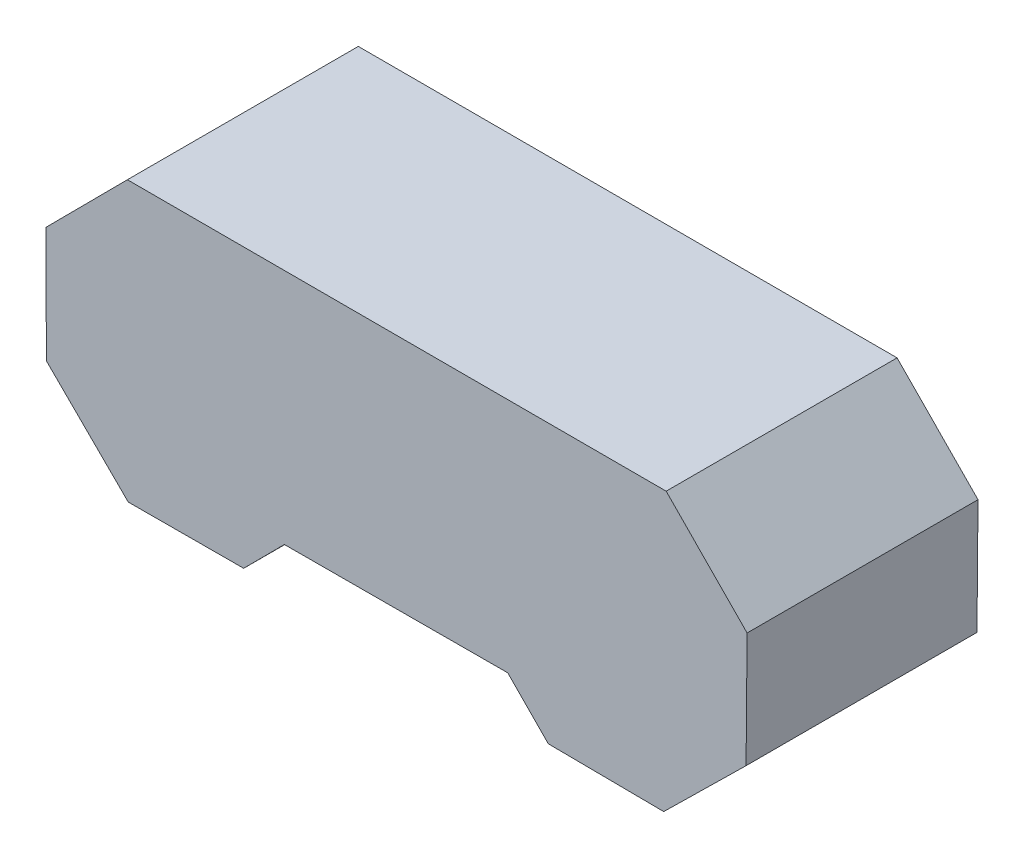
ISO-10303-21;
HEADER;
FILE_DESCRIPTION(('STEP AP214'),'2;1');
FILE_NAME('part.step','',(''),(''),'','','');
FILE_SCHEMA(('AUTOMOTIVE_DESIGN { 1 0 10303 214 1 1 1 1 }'));
ENDSEC;
DATA;
#1=APPLICATION_CONTEXT('core data for automotive mechanical design processes');
#2=APPLICATION_PROTOCOL_DEFINITION('international standard','automotive_design',2000,#1);
#3=PRODUCT_CONTEXT('',#1,'mechanical');
#4=PRODUCT('Part','Part','',(#3));
#5=PRODUCT_RELATED_PRODUCT_CATEGORY('part','',(#4));
#6=PRODUCT_DEFINITION_FORMATION('','',#4);
#7=PRODUCT_DEFINITION_CONTEXT('part definition',#1,'design');
#8=PRODUCT_DEFINITION('design','',#6,#7);
#9=PRODUCT_DEFINITION_SHAPE('','',#8);
#10=(LENGTH_UNIT() NAMED_UNIT(*) SI_UNIT(.MILLI.,.METRE.));
#11=(NAMED_UNIT(*) PLANE_ANGLE_UNIT() SI_UNIT($,.RADIAN.));
#12=(NAMED_UNIT(*) SI_UNIT($,.STERADIAN.) SOLID_ANGLE_UNIT());
#13=UNCERTAINTY_MEASURE_WITH_UNIT(LENGTH_MEASURE(1.E-05),#10,'distance_accuracy_value','');
#14=(GEOMETRIC_REPRESENTATION_CONTEXT(3) GLOBAL_UNCERTAINTY_ASSIGNED_CONTEXT((#13)) GLOBAL_UNIT_ASSIGNED_CONTEXT((#10,
#11,#12)) REPRESENTATION_CONTEXT('',''));
#15=CARTESIAN_POINT('',(0.,0.,0.));
#16=DIRECTION('',(0.,0.,1.));
#17=DIRECTION('',(1.,0.,0.));
#18=AXIS2_PLACEMENT_3D('',#15,#16,#17);
#19=CARTESIAN_POINT('',(-244.661916319518,37.8470245384613,152.4));
#20=DIRECTION('',(0.999995319641671,0.00305952524957669,0.));
#21=DIRECTION('',(-0.00305952524957669,0.999995319641671,0.));
#22=AXIS2_PLACEMENT_3D('',#19,#20,#21);
#23=PLANE('',#22);
#24=DIRECTION('',(0.00305952524957669,-0.999995319641671,0.));
#25=VECTOR('',#24,1.);
#26=CARTESIAN_POINT('',(-244.661916319518,37.8470245384613,0.));
#27=LINE('',#26,#25);
#28=CARTESIAN_POINT('',(-244.661916319518,37.8470245384613,0.));
#29=VERTEX_POINT('',#28);
#30=CARTESIAN_POINT('',(-244.428771462345,-38.3555712740827,0.));
#31=VERTEX_POINT('',#30);
#32=EDGE_CURVE('E154',#29,#31,#27,.T.);
#33=ORIENTED_EDGE('',*,*,#32,.T.);
#34=DIRECTION('',(0.,0.,-1.));
#35=VECTOR('',#34,1.);
#36=CARTESIAN_POINT('',(-244.428771462345,-38.3555712740827,152.4));
#37=LINE('',#36,#35);
#38=CARTESIAN_POINT('',(-244.428771462345,-38.3555712740827,152.4));
#39=VERTEX_POINT('',#38);
#40=EDGE_CURVE('E11',#39,#31,#37,.T.);
#41=ORIENTED_EDGE('',*,*,#40,.F.);
#42=DIRECTION('',(0.00305952524957669,-0.999995319641671,0.));
#43=VECTOR('',#42,1.);
#44=CARTESIAN_POINT('',(-244.661916319518,37.8470245384613,152.4));
#45=LINE('',#44,#43);
#46=CARTESIAN_POINT('',(-244.661916319518,37.8470245384613,152.4));
#47=VERTEX_POINT('',#46);
#48=EDGE_CURVE('E176',#47,#39,#45,.T.);
#49=ORIENTED_EDGE('',*,*,#48,.F.);
#50=DIRECTION('',(0.,0.,-1.));
#51=VECTOR('',#50,1.);
#52=CARTESIAN_POINT('',(-244.661916319518,37.8470245384613,152.4));
#53=LINE('',#52,#51);
#54=EDGE_CURVE('E150',#47,#29,#53,.T.);
#55=ORIENTED_EDGE('',*,*,#54,.T.);
#56=EDGE_LOOP('',(#33,#41,#49,#55));
#57=FACE_BOUND('',#56,.T.);
#58=ADVANCED_FACE('F34',(#57),#23,.F.);
#59=CARTESIAN_POINT('',(-244.428771462345,-38.3555712740827,152.4));
#60=DIRECTION('',(0.704940060622248,0.709266882724621,0.));
#61=DIRECTION('',(-0.709266882724621,0.704940060622248,0.));
#62=AXIS2_PLACEMENT_3D('',#59,#60,#61);
#63=PLANE('',#62);
#64=DIRECTION('',(0.709266882724621,-0.704940060622248,0.));
#65=VECTOR('',#64,1.);
#66=CARTESIAN_POINT('',(-244.428771462345,-38.3555712740827,0.));
#67=LINE('',#66,#65);
#68=CARTESIAN_POINT('',(-190.380540909772,-92.0740852076443,0.));
#69=VERTEX_POINT('',#68);
#70=EDGE_CURVE('E157',#31,#69,#67,.T.);
#71=ORIENTED_EDGE('',*,*,#70,.T.);
#72=DIRECTION('',(0.,0.,-1.));
#73=VECTOR('',#72,1.);
#74=CARTESIAN_POINT('',(-190.380540909772,-92.0740852076443,152.4));
#75=LINE('',#74,#73);
#76=CARTESIAN_POINT('',(-190.380540909772,-92.0740852076443,152.4));
#77=VERTEX_POINT('',#76);
#78=EDGE_CURVE('E42',#77,#69,#75,.T.);
#79=ORIENTED_EDGE('',*,*,#78,.F.);
#80=DIRECTION('',(0.709266882724621,-0.704940060622248,0.));
#81=VECTOR('',#80,1.);
#82=CARTESIAN_POINT('',(-244.428771462345,-38.3555712740827,152.4));
#83=LINE('',#82,#81);
#84=EDGE_CURVE('E105',#39,#77,#83,.T.);
#85=ORIENTED_EDGE('',*,*,#84,.F.);
#86=ORIENTED_EDGE('',*,*,#40,.T.);
#87=EDGE_LOOP('',(#71,#79,#85,#86));
#88=FACE_BOUND('',#87,.T.);
#89=ADVANCED_FACE('F254',(#88),#63,.F.);
#90=CARTESIAN_POINT('',(-190.380540909772,-92.0740852076443,152.4));
#91=DIRECTION('',(-0.00305952524957669,0.999995319641671,0.));
#92=DIRECTION('',(-0.999995319641671,-0.00305952524957669,0.));
#93=AXIS2_PLACEMENT_3D('',#90,#91,#92);
#94=PLANE('',#93);
#95=DIRECTION('',(0.999995319641671,0.00305952524957669,0.));
#96=VECTOR('',#95,1.);
#97=CARTESIAN_POINT('',(-190.380540909772,-92.0740852076443,0.));
#98=LINE('',#97,#96);
#99=CARTESIAN_POINT('',(-114.177945097228,-91.840940350471,0.));
#100=VERTEX_POINT('',#99);
#101=EDGE_CURVE('E159',#69,#100,#98,.T.);
#102=ORIENTED_EDGE('',*,*,#101,.T.);
#103=DIRECTION('',(0.,0.,-1.));
#104=VECTOR('',#103,1.);
#105=CARTESIAN_POINT('',(-114.177945097228,-91.840940350471,152.4));
#106=LINE('',#105,#104);
#107=CARTESIAN_POINT('',(-114.177945097228,-91.840940350471,152.4));
#108=VERTEX_POINT('',#107);
#109=EDGE_CURVE('E195',#108,#100,#106,.T.);
#110=ORIENTED_EDGE('',*,*,#109,.F.);
#111=DIRECTION('',(0.999995319641671,0.00305952524957669,0.));
#112=VECTOR('',#111,1.);
#113=CARTESIAN_POINT('',(-190.380540909772,-92.0740852076443,152.4));
#114=LINE('',#113,#112);
#115=EDGE_CURVE('E203',#77,#108,#114,.T.);
#116=ORIENTED_EDGE('',*,*,#115,.F.);
#117=ORIENTED_EDGE('',*,*,#78,.T.);
#118=EDGE_LOOP('',(#102,#110,#116,#117));
#119=FACE_BOUND('',#118,.T.);
#120=ADVANCED_FACE('F201',(#119),#94,.F.);
#121=CARTESIAN_POINT('',(-114.177945097228,-91.840940350471,152.4));
#122=DIRECTION('',(-0.709266882724622,0.704940060622247,0.));
#123=DIRECTION('',(-0.704940060622247,-0.709266882724622,0.));
#124=AXIS2_PLACEMENT_3D('',#121,#122,#123);
#125=PLANE('',#124);
#126=DIRECTION('',(0.704940060622247,0.709266882724622,0.));
#127=VECTOR('',#126,1.);
#128=CARTESIAN_POINT('',(-114.177945097228,-91.840940350471,0.));
#129=LINE('',#128,#127);
#130=CARTESIAN_POINT('',(-87.31972878752,-64.8178721186629,0.));
#131=VERTEX_POINT('',#130);
#132=EDGE_CURVE('E161',#100,#131,#129,.T.);
#133=ORIENTED_EDGE('',*,*,#132,.T.);
#134=DIRECTION('',(0.,0.,-1.));
#135=VECTOR('',#134,1.);
#136=CARTESIAN_POINT('',(-87.31972878752,-64.8178721186629,152.4));
#137=LINE('',#136,#135);
#138=CARTESIAN_POINT('',(-87.31972878752,-64.8178721186629,152.4));
#139=VERTEX_POINT('',#138);
#140=EDGE_CURVE('E192',#139,#131,#137,.T.);
#141=ORIENTED_EDGE('',*,*,#140,.F.);
#142=DIRECTION('',(0.704940060622247,0.709266882724622,0.));
#143=VECTOR('',#142,1.);
#144=CARTESIAN_POINT('',(-114.177945097228,-91.840940350471,152.4));
#145=LINE('',#144,#143);
#146=EDGE_CURVE('E221',#108,#139,#145,.T.);
#147=ORIENTED_EDGE('',*,*,#146,.F.);
#148=ORIENTED_EDGE('',*,*,#109,.T.);
#149=EDGE_LOOP('',(#133,#141,#147,#148));
#150=FACE_BOUND('',#149,.T.);
#151=ADVANCED_FACE('F212',(#150),#125,.F.);
#152=CARTESIAN_POINT('',(60.1345846239641,-64.4421052190364,152.4));
#153=DIRECTION('',(-0.00254835325461883,0.999996752942573,0.));
#154=DIRECTION('',(-0.999996752942573,-0.00254835325461883,0.));
#155=AXIS2_PLACEMENT_3D('',#152,#153,#154);
#156=PLANE('',#155);
#157=DIRECTION('',(0.999996752942573,0.00254835325461883,0.));
#158=VECTOR('',#157,1.);
#159=CARTESIAN_POINT('',(60.1345846239641,-64.4421052190364,0.));
#160=LINE('',#159,#158);
#161=CARTESIAN_POINT('',(60.1345846239641,-64.4421052190364,0.));
#162=VERTEX_POINT('',#161);
#163=EDGE_CURVE('E163',#131,#162,#160,.T.);
#164=ORIENTED_EDGE('',*,*,#163,.T.);
#165=DIRECTION('',(0.,0.,-1.));
#166=VECTOR('',#165,1.);
#167=CARTESIAN_POINT('',(60.1345846239641,-64.4421052190364,152.4));
#168=LINE('',#167,#166);
#169=CARTESIAN_POINT('',(60.1345846239641,-64.4421052190364,152.4));
#170=VERTEX_POINT('',#169);
#171=EDGE_CURVE('E189',#170,#162,#168,.T.);
#172=ORIENTED_EDGE('',*,*,#171,.F.);
#173=DIRECTION('',(0.999996752942573,0.00254835325461883,0.));
#174=VECTOR('',#173,1.);
#175=CARTESIAN_POINT('',(60.1345846239641,-64.4421052190364,152.4));
#176=LINE('',#175,#174);
#177=EDGE_CURVE('E218',#139,#170,#176,.T.);
#178=ORIENTED_EDGE('',*,*,#177,.F.);
#179=ORIENTED_EDGE('',*,*,#140,.T.);
#180=EDGE_LOOP('',(#164,#172,#178,#179));
#181=FACE_BOUND('',#180,.T.);
#182=ADVANCED_FACE('F216',(#181),#156,.F.);
#183=CARTESIAN_POINT('',(60.1345846239641,-64.4421052190364,152.4));
#184=DIRECTION('',(0.713303857876605,0.700854911046753,0.));
#185=DIRECTION('',(-0.700854911046753,0.713303857876605,0.));
#186=AXIS2_PLACEMENT_3D('',#183,#184,#185);
#187=PLANE('',#186);
#188=DIRECTION('',(0.700854911046753,-0.713303857876605,0.));
#189=VECTOR('',#188,1.);
#190=CARTESIAN_POINT('',(60.1345846239641,-64.4421052190364,0.));
#191=LINE('',#190,#189);
#192=CARTESIAN_POINT('',(86.8371567348454,-91.6189822041351,0.));
#193=VERTEX_POINT('',#192);
#194=EDGE_CURVE('E165',#162,#193,#191,.T.);
#195=ORIENTED_EDGE('',*,*,#194,.T.);
#196=DIRECTION('',(0.,0.,-1.));
#197=VECTOR('',#196,1.);
#198=CARTESIAN_POINT('',(86.8371567348454,-91.6189822041351,152.4));
#199=LINE('',#198,#197);
#200=CARTESIAN_POINT('',(86.8371567348454,-91.6189822041351,152.4));
#201=VERTEX_POINT('',#200);
#202=EDGE_CURVE('E186',#201,#193,#199,.T.);
#203=ORIENTED_EDGE('',*,*,#202,.F.);
#204=DIRECTION('',(0.700854911046753,-0.713303857876605,0.));
#205=VECTOR('',#204,1.);
#206=CARTESIAN_POINT('',(60.1345846239641,-64.4421052190364,152.4));
#207=LINE('',#206,#205);
#208=EDGE_CURVE('E220',#170,#201,#207,.T.);
#209=ORIENTED_EDGE('',*,*,#208,.F.);
#210=ORIENTED_EDGE('',*,*,#171,.T.);
#211=EDGE_LOOP('',(#195,#203,#209,#210));
#212=FACE_BOUND('',#211,.T.);
#213=ADVANCED_FACE('F267',(#212),#187,.F.);
#214=CARTESIAN_POINT('',(86.8371567348454,-91.6189822041351,152.4));
#215=DIRECTION('',(0.0088027347220188,0.999961255180126,0.));
#216=DIRECTION('',(-0.999961255180126,0.0088027347220188,0.));
#217=AXIS2_PLACEMENT_3D('',#214,#215,#216);
#218=PLANE('',#217);
#219=DIRECTION('',(0.999961255180126,-0.0088027347220188,0.));
#220=VECTOR('',#219,1.);
#221=CARTESIAN_POINT('',(86.8371567348454,-91.6189822041351,0.));
#222=LINE('',#221,#220);
#223=CARTESIAN_POINT('',(163.037156734845,-92.2897765797602,0.));
#224=VERTEX_POINT('',#223);
#225=EDGE_CURVE('E167',#193,#224,#222,.T.);
#226=ORIENTED_EDGE('',*,*,#225,.T.);
#227=DIRECTION('',(0.,0.,-1.));
#228=VECTOR('',#227,1.);
#229=CARTESIAN_POINT('',(163.037156734845,-92.2897765797602,152.4));
#230=LINE('',#229,#228);
#231=CARTESIAN_POINT('',(163.037156734845,-92.2897765797602,152.4));
#232=VERTEX_POINT('',#231);
#233=EDGE_CURVE('E183',#232,#224,#230,.T.);
#234=ORIENTED_EDGE('',*,*,#233,.F.);
#235=DIRECTION('',(0.999961255180126,-0.0088027347220188,0.));
#236=VECTOR('',#235,1.);
#237=CARTESIAN_POINT('',(86.8371567348454,-91.6189822041351,152.4));
#238=LINE('',#237,#236);
#239=EDGE_CURVE('E223',#201,#232,#238,.T.);
#240=ORIENTED_EDGE('',*,*,#239,.F.);
#241=ORIENTED_EDGE('',*,*,#202,.T.);
#242=EDGE_LOOP('',(#226,#234,#240,#241));
#243=FACE_BOUND('',#242,.T.);
#244=ADVANCED_FACE('F270',(#243),#218,.F.);
#245=CARTESIAN_POINT('',(163.037156734845,-92.2897765797602,152.4));
#246=DIRECTION('',(-0.700854911046753,0.713303857876605,0.));
#247=DIRECTION('',(-0.713303857876605,-0.700854911046753,0.));
#248=AXIS2_PLACEMENT_3D('',#245,#246,#247);
#249=PLANE('',#248);
#250=DIRECTION('',(0.713303857876605,0.700854911046753,0.));
#251=VECTOR('',#250,1.);
#252=CARTESIAN_POINT('',(163.037156734845,-92.2897765797602,0.));
#253=LINE('',#252,#251);
#254=CARTESIAN_POINT('',(217.393016713047,-38.8825631051315,0.));
#255=VERTEX_POINT('',#254);
#256=EDGE_CURVE('E169',#224,#255,#253,.T.);
#257=ORIENTED_EDGE('',*,*,#256,.T.);
#258=DIRECTION('',(0.,0.,-1.));
#259=VECTOR('',#258,1.);
#260=CARTESIAN_POINT('',(217.393016713047,-38.8825631051315,152.4));
#261=LINE('',#260,#259);
#262=CARTESIAN_POINT('',(217.393016713047,-38.8825631051315,152.4));
#263=VERTEX_POINT('',#262);
#264=EDGE_CURVE('E180',#263,#255,#261,.T.);
#265=ORIENTED_EDGE('',*,*,#264,.F.);
#266=DIRECTION('',(0.713303857876605,0.700854911046753,0.));
#267=VECTOR('',#266,1.);
#268=CARTESIAN_POINT('',(163.037156734845,-92.2897765797602,152.4));
#269=LINE('',#268,#267);
#270=EDGE_CURVE('E229',#232,#263,#269,.T.);
#271=ORIENTED_EDGE('',*,*,#270,.F.);
#272=ORIENTED_EDGE('',*,*,#233,.T.);
#273=EDGE_LOOP('',(#257,#265,#271,#272));
#274=FACE_BOUND('',#273,.T.);
#275=ADVANCED_FACE('F235',(#274),#249,.F.);
#276=CARTESIAN_POINT('',(217.393016713047,-38.8825631051315,152.4));
#277=DIRECTION('',(-0.999961255180126,0.00880273472201881,0.));
#278=DIRECTION('',(-0.00880273472201881,-0.999961255180126,0.));
#279=AXIS2_PLACEMENT_3D('',#276,#277,#278);
#280=PLANE('',#279);
#281=DIRECTION('',(0.0088027347220188,0.999961255180126,0.));
#282=VECTOR('',#281,1.);
#283=CARTESIAN_POINT('',(217.393016713047,-38.8825631051315,0.));
#284=LINE('',#283,#282);
#285=CARTESIAN_POINT('',(218.063811088672,37.3174368948685,0.));
#286=VERTEX_POINT('',#285);
#287=EDGE_CURVE('E171',#255,#286,#284,.T.);
#288=ORIENTED_EDGE('',*,*,#287,.T.);
#289=DIRECTION('',(0.,0.,-1.));
#290=VECTOR('',#289,1.);
#291=CARTESIAN_POINT('',(218.063811088672,37.3174368948685,152.4));
#292=LINE('',#291,#290);
#293=CARTESIAN_POINT('',(218.063811088672,37.3174368948685,152.4));
#294=VERTEX_POINT('',#293);
#295=EDGE_CURVE('E145',#294,#286,#292,.T.);
#296=ORIENTED_EDGE('',*,*,#295,.F.);
#297=DIRECTION('',(0.0088027347220188,0.999961255180126,0.));
#298=VECTOR('',#297,1.);
#299=CARTESIAN_POINT('',(217.393016713047,-38.8825631051315,152.4));
#300=LINE('',#299,#298);
#301=EDGE_CURVE('E136',#263,#294,#300,.T.);
#302=ORIENTED_EDGE('',*,*,#301,.F.);
#303=ORIENTED_EDGE('',*,*,#264,.T.);
#304=EDGE_LOOP('',(#288,#296,#302,#303));
#305=FACE_BOUND('',#304,.T.);
#306=ADVANCED_FACE('F239',(#305),#280,.F.);
#307=CARTESIAN_POINT('',(218.063811088672,37.3174368948685,152.4));
#308=DIRECTION('',(-0.713303857876605,-0.700854911046753,0.));
#309=DIRECTION('',(0.700854911046753,-0.713303857876605,0.));
#310=AXIS2_PLACEMENT_3D('',#307,#308,#309);
#311=PLANE('',#310);
#312=DIRECTION('',(-0.700854911046753,0.713303857876605,0.));
#313=VECTOR('',#312,1.);
#314=CARTESIAN_POINT('',(218.063811088672,37.3174368948685,0.));
#315=LINE('',#314,#313);
#316=CARTESIAN_POINT('',(164.656597614043,91.6732968730697,0.));
#317=VERTEX_POINT('',#316);
#318=EDGE_CURVE('E144',#286,#317,#315,.T.);
#319=ORIENTED_EDGE('',*,*,#318,.T.);
#320=DIRECTION('',(0.,0.,-1.));
#321=VECTOR('',#320,1.);
#322=CARTESIAN_POINT('',(164.656597614043,91.6732968730697,152.4));
#323=LINE('',#322,#321);
#324=CARTESIAN_POINT('',(164.656597614043,91.6732968730697,152.4));
#325=VERTEX_POINT('',#324);
#326=EDGE_CURVE('E141',#325,#317,#323,.T.);
#327=ORIENTED_EDGE('',*,*,#326,.F.);
#328=DIRECTION('',(-0.700854911046753,0.713303857876605,0.));
#329=VECTOR('',#328,1.);
#330=CARTESIAN_POINT('',(218.063811088672,37.3174368948685,152.4));
#331=LINE('',#330,#329);
#332=EDGE_CURVE('E130',#294,#325,#331,.T.);
#333=ORIENTED_EDGE('',*,*,#332,.F.);
#334=ORIENTED_EDGE('',*,*,#295,.T.);
#335=EDGE_LOOP('',(#319,#327,#333,#334));
#336=FACE_BOUND('',#335,.T.);
#337=ADVANCED_FACE('F142',(#336),#311,.F.);
#338=CARTESIAN_POINT('',(-190.943402385957,91.8952550910347,152.4));
#339=DIRECTION('',(-0.000624179344003242,-0.999999805200054,0.));
#340=DIRECTION('',(0.999999805200054,-0.000624179344003242,0.));
#341=AXIS2_PLACEMENT_3D('',#338,#339,#340);
#342=PLANE('',#341);
#343=DIRECTION('',(-0.999999805200054,0.000624179344003242,0.));
#344=VECTOR('',#343,1.);
#345=CARTESIAN_POINT('',(-190.943402385957,91.8952550910347,0.));
#346=LINE('',#345,#344);
#347=CARTESIAN_POINT('',(-190.943402385957,91.8952550910347,0.));
#348=VERTEX_POINT('',#347);
#349=EDGE_CURVE('E91',#317,#348,#346,.T.);
#350=ORIENTED_EDGE('',*,*,#349,.T.);
#351=DIRECTION('',(0.,0.,-1.));
#352=VECTOR('',#351,1.);
#353=CARTESIAN_POINT('',(-190.943402385957,91.8952550910347,152.4));
#354=LINE('',#353,#352);
#355=CARTESIAN_POINT('',(-190.943402385957,91.8952550910347,152.4));
#356=VERTEX_POINT('',#355);
#357=EDGE_CURVE('E146',#356,#348,#354,.T.);
#358=ORIENTED_EDGE('',*,*,#357,.F.);
#359=DIRECTION('',(-0.999999805200054,0.000624179344003242,0.));
#360=VECTOR('',#359,1.);
#361=CARTESIAN_POINT('',(-190.943402385957,91.8952550910347,152.4));
#362=LINE('',#361,#360);
#363=EDGE_CURVE('E134',#325,#356,#362,.T.);
#364=ORIENTED_EDGE('',*,*,#363,.F.);
#365=ORIENTED_EDGE('',*,*,#326,.T.);
#366=EDGE_LOOP('',(#350,#358,#364,#365));
#367=FACE_BOUND('',#366,.T.);
#368=ADVANCED_FACE('F148',(#367),#342,.F.);
#369=CARTESIAN_POINT('',(-190.943402385957,91.8952550910347,152.4));
#370=DIRECTION('',(0.709266882724621,-0.704940060622248,0.));
#371=DIRECTION('',(0.704940060622248,0.709266882724621,0.));
#372=AXIS2_PLACEMENT_3D('',#369,#370,#371);
#373=PLANE('',#372);
#374=DIRECTION('',(-0.704940060622248,-0.709266882724621,0.));
#375=VECTOR('',#374,1.);
#376=CARTESIAN_POINT('',(-190.943402385957,91.8952550910347,0.));
#377=LINE('',#376,#375);
#378=EDGE_CURVE('E97',#348,#29,#377,.T.);
#379=ORIENTED_EDGE('',*,*,#378,.T.);
#380=ORIENTED_EDGE('',*,*,#54,.F.);
#381=DIRECTION('',(-0.704940060622248,-0.709266882724621,0.));
#382=VECTOR('',#381,1.);
#383=CARTESIAN_POINT('',(-190.943402385957,91.8952550910347,152.4));
#384=LINE('',#383,#382);
#385=EDGE_CURVE('E50',#356,#47,#384,.T.);
#386=ORIENTED_EDGE('',*,*,#385,.F.);
#387=ORIENTED_EDGE('',*,*,#357,.T.);
#388=EDGE_LOOP('',(#379,#380,#386,#387));
#389=FACE_BOUND('',#388,.T.);
#390=ADVANCED_FACE('F243',(#389),#373,.F.);
#391=CARTESIAN_POINT('',(0.,0.,152.4));
#392=DIRECTION('',(0.,0.,1.));
#393=DIRECTION('',(1.,0.,0.));
#394=AXIS2_PLACEMENT_3D('',#391,#392,#393);
#395=PLANE('',#394);
#396=ORIENTED_EDGE('',*,*,#48,.T.);
#397=ORIENTED_EDGE('',*,*,#84,.T.);
#398=ORIENTED_EDGE('',*,*,#115,.T.);
#399=ORIENTED_EDGE('',*,*,#146,.T.);
#400=ORIENTED_EDGE('',*,*,#177,.T.);
#401=ORIENTED_EDGE('',*,*,#208,.T.);
#402=ORIENTED_EDGE('',*,*,#239,.T.);
#403=ORIENTED_EDGE('',*,*,#270,.T.);
#404=ORIENTED_EDGE('',*,*,#301,.T.);
#405=ORIENTED_EDGE('',*,*,#332,.T.);
#406=ORIENTED_EDGE('',*,*,#363,.T.);
#407=ORIENTED_EDGE('',*,*,#385,.T.);
#408=EDGE_LOOP('',(#396,#397,#398,#399,#400,#401,#402,#403,#404,#405,#406,#407));
#409=FACE_BOUND('',#408,.T.);
#410=ADVANCED_FACE('F132',(#409),#395,.T.);
#411=CARTESIAN_POINT('',(0.,0.,0.));
#412=DIRECTION('',(0.,0.,1.));
#413=DIRECTION('',(1.,0.,0.));
#414=AXIS2_PLACEMENT_3D('',#411,#412,#413);
#415=PLANE('',#414);
#416=ORIENTED_EDGE('',*,*,#32,.F.);
#417=ORIENTED_EDGE('',*,*,#378,.F.);
#418=ORIENTED_EDGE('',*,*,#349,.F.);
#419=ORIENTED_EDGE('',*,*,#318,.F.);
#420=ORIENTED_EDGE('',*,*,#287,.F.);
#421=ORIENTED_EDGE('',*,*,#256,.F.);
#422=ORIENTED_EDGE('',*,*,#225,.F.);
#423=ORIENTED_EDGE('',*,*,#194,.F.);
#424=ORIENTED_EDGE('',*,*,#163,.F.);
#425=ORIENTED_EDGE('',*,*,#132,.F.);
#426=ORIENTED_EDGE('',*,*,#101,.F.);
#427=ORIENTED_EDGE('',*,*,#70,.F.);
#428=EDGE_LOOP('',(#416,#417,#418,#419,#420,#421,#422,#423,#424,#425,#426,#427));
#429=FACE_BOUND('',#428,.T.);
#430=ADVANCED_FACE('F207',(#429),#415,.F.);
#431=CLOSED_SHELL('',(#58,#89,#120,#151,#182,#213,#244,#275,#306,#337,#368,#390,#410,#430));
#432=MANIFOLD_SOLID_BREP('B2',#431);
#433=ADVANCED_BREP_SHAPE_REPRESENTATION('',(#18,#432),#14);
#434=SHAPE_DEFINITION_REPRESENTATION(#9,#433);
ENDSEC;
END-ISO-10303-21;
